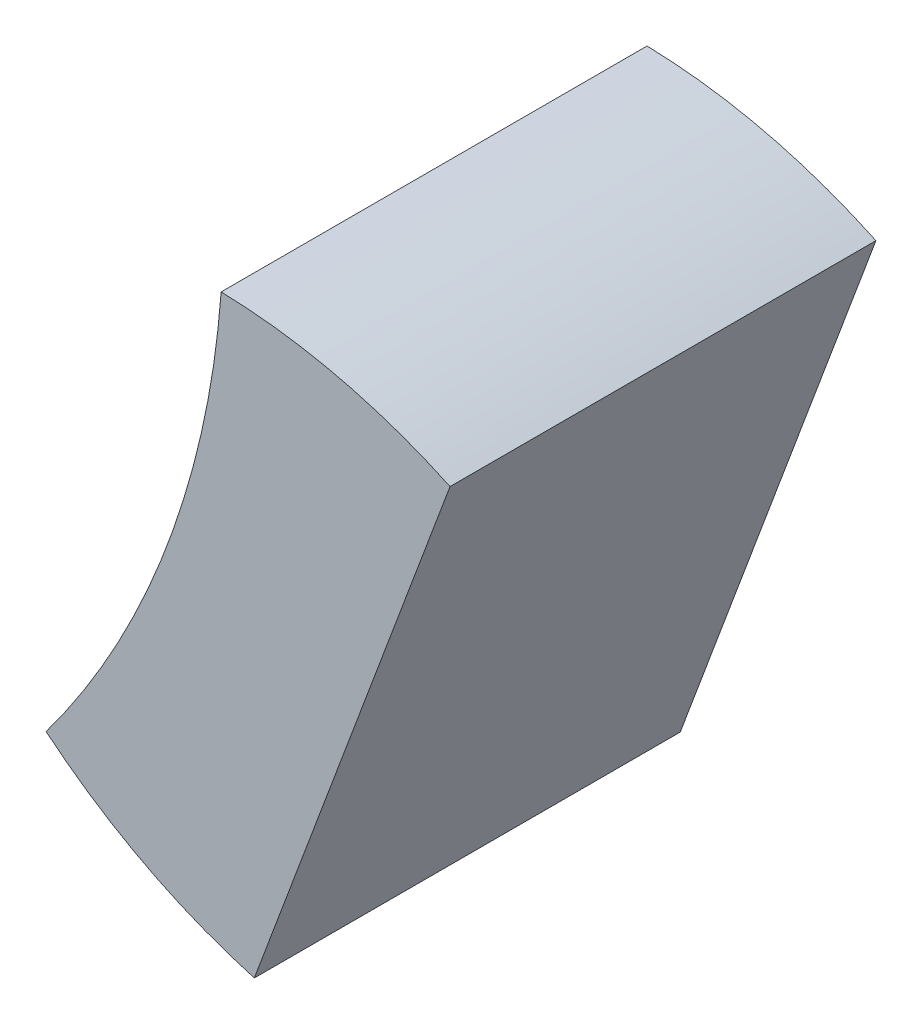
ISO-10303-21;
HEADER;
FILE_DESCRIPTION(('STEP AP214'),'2;1');
FILE_NAME('part.step','',(''),(''),'','','');
FILE_SCHEMA(('AUTOMOTIVE_DESIGN { 1 0 10303 214 1 1 1 1 }'));
ENDSEC;
DATA;
#1=APPLICATION_CONTEXT('core data for automotive mechanical design processes');
#2=APPLICATION_PROTOCOL_DEFINITION('international standard','automotive_design',2000,#1);
#3=PRODUCT_CONTEXT('',#1,'mechanical');
#4=PRODUCT('Part','Part','',(#3));
#5=PRODUCT_RELATED_PRODUCT_CATEGORY('part','',(#4));
#6=PRODUCT_DEFINITION_FORMATION('','',#4);
#7=PRODUCT_DEFINITION_CONTEXT('part definition',#1,'design');
#8=PRODUCT_DEFINITION('design','',#6,#7);
#9=PRODUCT_DEFINITION_SHAPE('','',#8);
#10=(LENGTH_UNIT() NAMED_UNIT(*) SI_UNIT(.MILLI.,.METRE.));
#11=(NAMED_UNIT(*) PLANE_ANGLE_UNIT() SI_UNIT($,.RADIAN.));
#12=(NAMED_UNIT(*) SI_UNIT($,.STERADIAN.) SOLID_ANGLE_UNIT());
#13=UNCERTAINTY_MEASURE_WITH_UNIT(LENGTH_MEASURE(1.E-05),#10,'distance_accuracy_value','');
#14=(GEOMETRIC_REPRESENTATION_CONTEXT(3) GLOBAL_UNCERTAINTY_ASSIGNED_CONTEXT((#13)) GLOBAL_UNIT_ASSIGNED_CONTEXT((#10,
#11,#12)) REPRESENTATION_CONTEXT('',''));
#15=CARTESIAN_POINT('',(0.,0.,0.));
#16=DIRECTION('',(0.,0.,1.));
#17=DIRECTION('',(1.,0.,0.));
#18=AXIS2_PLACEMENT_3D('',#15,#16,#17);
#19=CARTESIAN_POINT('',(-34.490029216,104.956120538,116.5));
#20=DIRECTION('',(0.,0.,-1.));
#21=DIRECTION('',(-1.,0.,0.));
#22=AXIS2_PLACEMENT_3D('',#19,#20,#21);
#23=CYLINDRICAL_SURFACE('',#22,33.5);
#24=CARTESIAN_POINT('',(-34.490029216,104.956120538,99.5));
#25=DIRECTION('',(0.,0.,-1.));
#26=DIRECTION('',(-1.,0.,0.));
#27=AXIS2_PLACEMENT_3D('',#24,#25,#26);
#28=CIRCLE('',#27,33.5);
#29=CARTESIAN_POINT('',(-7.65791523716625,84.8990105908863,99.5));
#30=VERTEX_POINT('',#29);
#31=CARTESIAN_POINT('',(-1.08092766215445,102.48996292429,99.5));
#32=VERTEX_POINT('',#31);
#33=EDGE_CURVE('E20',#30,#32,#28,.F.);
#34=ORIENTED_EDGE('',*,*,#33,.F.);
#35=DIRECTION('',(0.,0.,-1.));
#36=VECTOR('',#35,1.);
#37=CARTESIAN_POINT('',(-7.65791523712324,84.8990105908508,116.5));
#38=LINE('',#37,#36);
#39=CARTESIAN_POINT('',(-7.65791523716625,84.8990105908863,115.5));
#40=VERTEX_POINT('',#39);
#41=EDGE_CURVE('E54',#40,#30,#38,.T.);
#42=ORIENTED_EDGE('',*,*,#41,.F.);
#43=CARTESIAN_POINT('',(-34.490029216,104.956120538,115.5));
#44=DIRECTION('',(0.,0.,-1.));
#45=DIRECTION('',(-1.,0.,0.));
#46=AXIS2_PLACEMENT_3D('',#43,#44,#45);
#47=CIRCLE('',#46,33.5);
#48=CARTESIAN_POINT('',(-1.08092766215445,102.48996292429,115.5));
#49=VERTEX_POINT('',#48);
#50=EDGE_CURVE('E74',#40,#49,#47,.F.);
#51=ORIENTED_EDGE('',*,*,#50,.T.);
#52=DIRECTION('',(0.,0.,-1.));
#53=VECTOR('',#52,1.);
#54=CARTESIAN_POINT('',(-1.08092766199277,102.489962924286,116.5));
#55=LINE('',#54,#53);
#56=EDGE_CURVE('E66',#32,#49,#55,.F.);
#57=ORIENTED_EDGE('',*,*,#56,.F.);
#58=EDGE_LOOP('',(#34,#42,#51,#57));
#59=FACE_BOUND('',#58,.T.);
#60=ADVANCED_FACE('F17',(#59),#23,.F.);
#61=CARTESIAN_POINT('',(53.21530671,62.555954853,99.5));
#62=DIRECTION('',(0.,0.,-1.));
#63=DIRECTION('',(-1.,0.,0.));
#64=AXIS2_PLACEMENT_3D('',#61,#62,#63);
#65=PLANE('',#64);
#66=CARTESIAN_POINT('',(-1.623812958,80.996818074,99.5));
#67=DIRECTION('',(0.,0.,-1.));
#68=DIRECTION('',(-1.,0.,0.));
#69=AXIS2_PLACEMENT_3D('',#66,#67,#68);
#70=CIRCLE('',#69,21.5);
#71=CARTESIAN_POINT('',(7.51774708810058,100.456568327269,99.5));
#72=VERTEX_POINT('',#71);
#73=EDGE_CURVE('E79',#72,#32,#70,.F.);
#74=ORIENTED_EDGE('',*,*,#73,.F.);
#75=DIRECTION('',(-0.350207381113304,-0.936672189303046,0.));
#76=VECTOR('',#75,1.);
#77=CARTESIAN_POINT('',(7.517747088,100.456568327,99.5));
#78=LINE('',#77,#76);
#79=CARTESIAN_POINT('',(0.165613862176827,80.7923947656454,99.5));
#80=VERTEX_POINT('',#79);
#81=EDGE_CURVE('E73',#72,#80,#78,.T.);
#82=ORIENTED_EDGE('',*,*,#81,.T.);
#83=CARTESIAN_POINT('',(6.033135769,101.476257719,99.5));
#84=DIRECTION('',(0.,0.,-1.));
#85=DIRECTION('',(-1.,0.,0.));
#86=AXIS2_PLACEMENT_3D('',#83,#84,#85);
#87=CIRCLE('',#86,21.5);
#88=EDGE_CURVE('E59',#30,#80,#87,.F.);
#89=ORIENTED_EDGE('',*,*,#88,.F.);
#90=ORIENTED_EDGE('',*,*,#33,.T.);
#91=EDGE_LOOP('',(#74,#82,#89,#90));
#92=FACE_BOUND('',#91,.T.);
#93=ADVANCED_FACE('F71',(#92),#65,.T.);
#94=CARTESIAN_POINT('',(6.033135769,101.476257719,116.5));
#95=DIRECTION('',(0.,0.,-1.));
#96=DIRECTION('',(-1.,0.,0.));
#97=AXIS2_PLACEMENT_3D('',#94,#95,#96);
#98=CYLINDRICAL_SURFACE('',#97,21.5);
#99=ORIENTED_EDGE('',*,*,#88,.T.);
#100=DIRECTION('',(0.,0.,1.));
#101=VECTOR('',#100,1.);
#102=CARTESIAN_POINT('',(0.165613862175167,80.792394765641,115.5));
#103=LINE('',#102,#101);
#104=CARTESIAN_POINT('',(0.165613862176827,80.7923947656454,115.5));
#105=VERTEX_POINT('',#104);
#106=EDGE_CURVE('E82',#80,#105,#103,.T.);
#107=ORIENTED_EDGE('',*,*,#106,.T.);
#108=CARTESIAN_POINT('',(6.033135769,101.476257719,115.5));
#109=DIRECTION('',(0.,0.,-1.));
#110=DIRECTION('',(-1.,0.,0.));
#111=AXIS2_PLACEMENT_3D('',#108,#109,#110);
#112=CIRCLE('',#111,21.5);
#113=EDGE_CURVE('E61',#105,#40,#112,.T.);
#114=ORIENTED_EDGE('',*,*,#113,.T.);
#115=ORIENTED_EDGE('',*,*,#41,.T.);
#116=EDGE_LOOP('',(#99,#107,#114,#115));
#117=FACE_BOUND('',#116,.T.);
#118=ADVANCED_FACE('F56',(#117),#98,.T.);
#119=CARTESIAN_POINT('',(53.21530671,62.555954853,115.5));
#120=DIRECTION('',(0.,0.,-1.));
#121=DIRECTION('',(-1.,0.,0.));
#122=AXIS2_PLACEMENT_3D('',#119,#120,#121);
#123=PLANE('',#122);
#124=DIRECTION('',(-0.350207381113304,-0.936672189303046,0.));
#125=VECTOR('',#124,1.);
#126=CARTESIAN_POINT('',(7.517747088,100.456568327,115.5));
#127=LINE('',#126,#125);
#128=CARTESIAN_POINT('',(7.51774708810058,100.456568327269,115.5));
#129=VERTEX_POINT('',#128);
#130=EDGE_CURVE('E26',#105,#129,#127,.F.);
#131=ORIENTED_EDGE('',*,*,#130,.T.);
#132=CARTESIAN_POINT('',(-1.623812958,80.996818074,115.5));
#133=DIRECTION('',(0.,0.,-1.));
#134=DIRECTION('',(-1.,0.,0.));
#135=AXIS2_PLACEMENT_3D('',#132,#133,#134);
#136=CIRCLE('',#135,21.5);
#137=EDGE_CURVE('E34',#49,#129,#136,.T.);
#138=ORIENTED_EDGE('',*,*,#137,.F.);
#139=ORIENTED_EDGE('',*,*,#50,.F.);
#140=ORIENTED_EDGE('',*,*,#113,.F.);
#141=EDGE_LOOP('',(#131,#138,#139,#140));
#142=FACE_BOUND('',#141,.T.);
#143=ADVANCED_FACE('F90',(#142),#123,.F.);
#144=CARTESIAN_POINT('',(-1.623812958,80.996818074,116.5));
#145=DIRECTION('',(0.,0.,-1.));
#146=DIRECTION('',(-1.,0.,0.));
#147=AXIS2_PLACEMENT_3D('',#144,#145,#146);
#148=CYLINDRICAL_SURFACE('',#147,21.5);
#149=ORIENTED_EDGE('',*,*,#73,.T.);
#150=ORIENTED_EDGE('',*,*,#56,.T.);
#151=ORIENTED_EDGE('',*,*,#137,.T.);
#152=DIRECTION('',(0.,0.,1.));
#153=VECTOR('',#152,1.);
#154=CARTESIAN_POINT('',(7.51774708806842,100.456568327183,115.5));
#155=LINE('',#154,#153);
#156=EDGE_CURVE('E11',#129,#72,#155,.F.);
#157=ORIENTED_EDGE('',*,*,#156,.T.);
#158=EDGE_LOOP('',(#149,#150,#151,#157));
#159=FACE_BOUND('',#158,.T.);
#160=ADVANCED_FACE('F91',(#159),#148,.T.);
#161=CARTESIAN_POINT('',(7.517747088,100.456568327,115.5));
#162=DIRECTION('',(-0.936672189303046,0.350207381113304,0.));
#163=DIRECTION('',(-0.350207381113304,-0.936672189303046,0.));
#164=AXIS2_PLACEMENT_3D('',#161,#162,#163);
#165=PLANE('',#164);
#166=ORIENTED_EDGE('',*,*,#130,.F.);
#167=ORIENTED_EDGE('',*,*,#106,.F.);
#168=ORIENTED_EDGE('',*,*,#81,.F.);
#169=ORIENTED_EDGE('',*,*,#156,.F.);
#170=EDGE_LOOP('',(#166,#167,#168,#169));
#171=FACE_BOUND('',#170,.T.);
#172=ADVANCED_FACE('F88',(#171),#165,.F.);
#173=CLOSED_SHELL('',(#60,#93,#118,#143,#160,#172));
#174=MANIFOLD_SOLID_BREP('B1',#173);
#175=ADVANCED_BREP_SHAPE_REPRESENTATION('',(#18,#174),#14);
#176=SHAPE_DEFINITION_REPRESENTATION(#9,#175);
ENDSEC;
END-ISO-10303-21;
